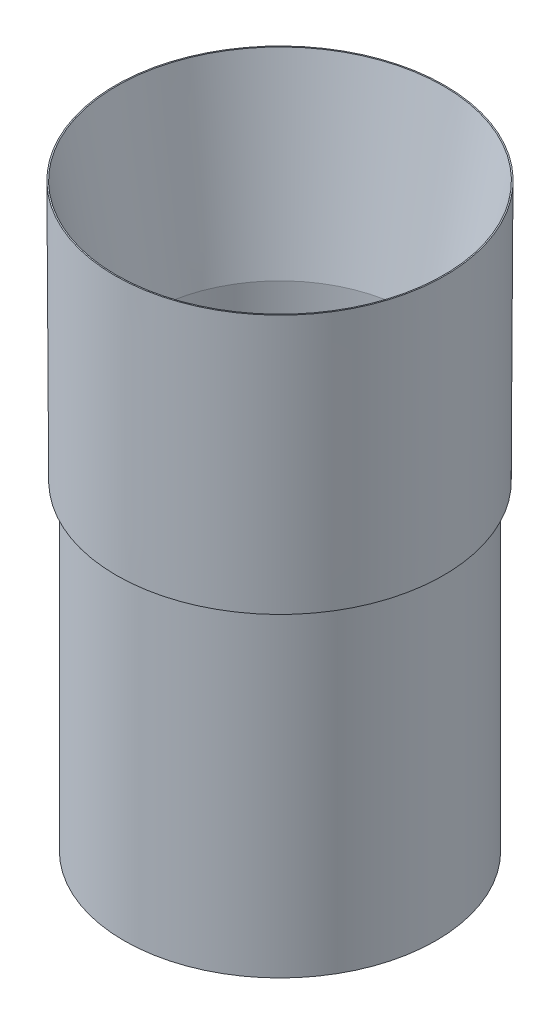
ISO-10303-21;
HEADER;
FILE_DESCRIPTION(('STEP AP214'),'2;1');
FILE_NAME('part.step','',(''),(''),'','','');
FILE_SCHEMA(('AUTOMOTIVE_DESIGN { 1 0 10303 214 1 1 1 1 }'));
ENDSEC;
DATA;
#1=APPLICATION_CONTEXT('core data for automotive mechanical design processes');
#2=APPLICATION_PROTOCOL_DEFINITION('international standard','automotive_design',2000,#1);
#3=PRODUCT_CONTEXT('',#1,'mechanical');
#4=PRODUCT('Part','Part','',(#3));
#5=PRODUCT_RELATED_PRODUCT_CATEGORY('part','',(#4));
#6=PRODUCT_DEFINITION_FORMATION('','',#4);
#7=PRODUCT_DEFINITION_CONTEXT('part definition',#1,'design');
#8=PRODUCT_DEFINITION('design','',#6,#7);
#9=PRODUCT_DEFINITION_SHAPE('','',#8);
#10=(LENGTH_UNIT() NAMED_UNIT(*) SI_UNIT(.MILLI.,.METRE.));
#11=(NAMED_UNIT(*) PLANE_ANGLE_UNIT() SI_UNIT($,.RADIAN.));
#12=(NAMED_UNIT(*) SI_UNIT($,.STERADIAN.) SOLID_ANGLE_UNIT());
#13=UNCERTAINTY_MEASURE_WITH_UNIT(LENGTH_MEASURE(1.E-05),#10,'distance_accuracy_value','');
#14=(GEOMETRIC_REPRESENTATION_CONTEXT(3) GLOBAL_UNCERTAINTY_ASSIGNED_CONTEXT((#13)) GLOBAL_UNIT_ASSIGNED_CONTEXT((#10,
#11,#12)) REPRESENTATION_CONTEXT('',''));
#15=CARTESIAN_POINT('',(0.,0.,0.));
#16=DIRECTION('',(0.,0.,1.));
#17=DIRECTION('',(1.,0.,0.));
#18=AXIS2_PLACEMENT_3D('',#15,#16,#17);
#19=CARTESIAN_POINT('',(0.,0.,0.));
#20=DIRECTION('',(0.,-1.,0.));
#21=DIRECTION('',(0.,0.,-1.));
#22=AXIS2_PLACEMENT_3D('',#19,#20,#21);
#23=CYLINDRICAL_SURFACE('',#22,49.53);
#24=CARTESIAN_POINT('',(0.,-101.6,0.));
#25=DIRECTION('',(0.,-1.,0.));
#26=DIRECTION('',(0.,0.,-1.));
#27=AXIS2_PLACEMENT_3D('',#24,#25,#26);
#28=CIRCLE('',#27,49.53);
#29=CARTESIAN_POINT('',(0.,-101.6,-49.53));
#30=VERTEX_POINT('',#29);
#31=EDGE_CURVE('E10',#30,#30,#28,.T.);
#32=ORIENTED_EDGE('',*,*,#31,.F.);
#33=EDGE_LOOP('',(#32));
#34=FACE_BOUND('',#33,.T.);
#35=CARTESIAN_POINT('',(0.,0.,0.));
#36=DIRECTION('',(0.,-1.,0.));
#37=DIRECTION('',(0.,0.,-1.));
#38=AXIS2_PLACEMENT_3D('',#35,#36,#37);
#39=CIRCLE('',#38,49.53);
#40=CARTESIAN_POINT('',(0.,0.,-49.53));
#41=VERTEX_POINT('',#40);
#42=EDGE_CURVE('E72',#41,#41,#39,.T.);
#43=ORIENTED_EDGE('',*,*,#42,.T.);
#44=EDGE_LOOP('',(#43));
#45=FACE_BOUND('',#44,.T.);
#46=ADVANCED_FACE('F41',(#34,#45),#23,.T.);
#47=CARTESIAN_POINT('',(-47.244,-101.6,0.));
#48=DIRECTION('',(0.,1.,0.));
#49=DIRECTION('',(0.,0.,1.));
#50=AXIS2_PLACEMENT_3D('',#47,#48,#49);
#51=PLANE('',#50);
#52=CARTESIAN_POINT('',(0.,-101.6,0.));
#53=DIRECTION('',(0.,-1.,0.));
#54=DIRECTION('',(0.,0.,-1.));
#55=AXIS2_PLACEMENT_3D('',#52,#53,#54);
#56=CIRCLE('',#55,47.244);
#57=CARTESIAN_POINT('',(0.,-101.6,-47.244));
#58=VERTEX_POINT('',#57);
#59=EDGE_CURVE('E47',#58,#58,#56,.T.);
#60=ORIENTED_EDGE('',*,*,#59,.F.);
#61=EDGE_LOOP('',(#60));
#62=FACE_BOUND('',#61,.T.);
#63=ORIENTED_EDGE('',*,*,#31,.T.);
#64=EDGE_LOOP('',(#63));
#65=FACE_BOUND('',#64,.T.);
#66=ADVANCED_FACE('F115',(#62,#65),#51,.F.);
#67=CARTESIAN_POINT('',(0.,0.,0.));
#68=DIRECTION('',(0.,-1.,0.));
#69=DIRECTION('',(0.,0.,-1.));
#70=AXIS2_PLACEMENT_3D('',#67,#68,#69);
#71=CYLINDRICAL_SURFACE('',#70,47.244);
#72=CARTESIAN_POINT('',(0.,0.,0.));
#73=DIRECTION('',(0.,-1.,0.));
#74=DIRECTION('',(0.,0.,-1.));
#75=AXIS2_PLACEMENT_3D('',#72,#73,#74);
#76=CIRCLE('',#75,47.244);
#77=CARTESIAN_POINT('',(0.,0.,-47.244));
#78=VERTEX_POINT('',#77);
#79=EDGE_CURVE('E51',#78,#78,#76,.T.);
#80=ORIENTED_EDGE('',*,*,#79,.F.);
#81=EDGE_LOOP('',(#80));
#82=FACE_BOUND('',#81,.T.);
#83=ORIENTED_EDGE('',*,*,#59,.T.);
#84=EDGE_LOOP('',(#83));
#85=FACE_BOUND('',#84,.T.);
#86=ADVANCED_FACE('F110',(#82,#85),#71,.F.);
#87=CARTESIAN_POINT('',(-41.866089445666,0.,0.));
#88=DIRECTION('',(0.,1.,0.));
#89=DIRECTION('',(0.,0.,1.));
#90=AXIS2_PLACEMENT_3D('',#87,#88,#89);
#91=PLANE('',#90);
#92=CARTESIAN_POINT('',(0.,0.,0.));
#93=DIRECTION('',(0.,-1.,0.));
#94=DIRECTION('',(0.,0.,-1.));
#95=AXIS2_PLACEMENT_3D('',#92,#93,#94);
#96=CIRCLE('',#95,41.866089445666);
#97=CARTESIAN_POINT('',(0.,0.,-41.866089445666));
#98=VERTEX_POINT('',#97);
#99=EDGE_CURVE('E55',#98,#98,#96,.T.);
#100=ORIENTED_EDGE('',*,*,#99,.F.);
#101=EDGE_LOOP('',(#100));
#102=FACE_BOUND('',#101,.T.);
#103=ORIENTED_EDGE('',*,*,#79,.T.);
#104=EDGE_LOOP('',(#103));
#105=FACE_BOUND('',#104,.T.);
#106=ADVANCED_FACE('F104',(#102,#105),#91,.F.);
#107=CARTESIAN_POINT('',(0.,0.,0.));
#108=DIRECTION('',(0.,-1.,0.));
#109=DIRECTION('',(0.,0.,-1.));
#110=AXIS2_PLACEMENT_3D('',#107,#108,#109);
#111=CYLINDRICAL_SURFACE('',#110,41.866089445666);
#112=CARTESIAN_POINT('',(0.,25.4,0.));
#113=DIRECTION('',(0.,-1.,0.));
#114=DIRECTION('',(0.,0.,-1.));
#115=AXIS2_PLACEMENT_3D('',#112,#113,#114);
#116=CIRCLE('',#115,41.866089445666);
#117=CARTESIAN_POINT('',(0.,25.4,-41.866089445666));
#118=VERTEX_POINT('',#117);
#119=EDGE_CURVE('E60',#118,#118,#116,.T.);
#120=ORIENTED_EDGE('',*,*,#119,.F.);
#121=EDGE_LOOP('',(#120));
#122=FACE_BOUND('',#121,.T.);
#123=ORIENTED_EDGE('',*,*,#99,.T.);
#124=EDGE_LOOP('',(#123));
#125=FACE_BOUND('',#124,.T.);
#126=ADVANCED_FACE('F98',(#122,#125),#111,.F.);
#127=CARTESIAN_POINT('',(0.,25.4,0.));
#128=DIRECTION('',(0.,1.,0.));
#129=DIRECTION('',(0.,0.,1.));
#130=AXIS2_PLACEMENT_3D('',#127,#128,#129);
#131=CONICAL_SURFACE('',#130,41.866089445666,0.174532925199434);
#132=CARTESIAN_POINT('',(0.,82.5489996247077,0.));
#133=DIRECTION('',(0.,-1.,0.));
#134=DIRECTION('',(0.,0.,-1.));
#135=AXIS2_PLACEMENT_3D('',#132,#133,#134);
#136=CIRCLE('',#135,51.943);
#137=CARTESIAN_POINT('',(0.,82.5489996247077,-51.943));
#138=VERTEX_POINT('',#137);
#139=EDGE_CURVE('E63',#138,#138,#136,.T.);
#140=ORIENTED_EDGE('',*,*,#139,.F.);
#141=EDGE_LOOP('',(#140));
#142=FACE_BOUND('',#141,.T.);
#143=ORIENTED_EDGE('',*,*,#119,.T.);
#144=EDGE_LOOP('',(#143));
#145=FACE_BOUND('',#144,.T.);
#146=ADVANCED_FACE('F92',(#142,#145),#131,.F.);
#147=CARTESIAN_POINT('',(-52.324,82.5489996247077,0.));
#148=DIRECTION('',(0.,-1.,0.));
#149=DIRECTION('',(0.,0.,-1.));
#150=AXIS2_PLACEMENT_3D('',#147,#148,#149);
#151=PLANE('',#150);
#152=CARTESIAN_POINT('',(0.,82.5489996247077,0.));
#153=DIRECTION('',(0.,-1.,0.));
#154=DIRECTION('',(0.,0.,-1.));
#155=AXIS2_PLACEMENT_3D('',#152,#153,#154);
#156=CIRCLE('',#155,52.324);
#157=CARTESIAN_POINT('',(0.,82.5489996247077,-52.324));
#158=VERTEX_POINT('',#157);
#159=EDGE_CURVE('E66',#158,#158,#156,.T.);
#160=ORIENTED_EDGE('',*,*,#159,.F.);
#161=EDGE_LOOP('',(#160));
#162=FACE_BOUND('',#161,.T.);
#163=ORIENTED_EDGE('',*,*,#139,.T.);
#164=EDGE_LOOP('',(#163));
#165=FACE_BOUND('',#164,.T.);
#166=ADVANCED_FACE('F86',(#162,#165),#151,.F.);
#167=CARTESIAN_POINT('',(0.,82.5489996247077,0.));
#168=DIRECTION('',(0.,1.,0.));
#169=DIRECTION('',(0.,0.,1.));
#170=AXIS2_PLACEMENT_3D('',#167,#168,#169);
#171=CONICAL_SURFACE('',#170,52.324,0.00492309680980575);
#172=CARTESIAN_POINT('',(0.,0.,0.));
#173=DIRECTION('',(0.,-1.,0.));
#174=DIRECTION('',(0.,0.,-1.));
#175=AXIS2_PLACEMENT_3D('',#172,#173,#174);
#176=CIRCLE('',#175,51.9176);
#177=CARTESIAN_POINT('',(0.,0.,-51.9176));
#178=VERTEX_POINT('',#177);
#179=EDGE_CURVE('E69',#178,#178,#176,.T.);
#180=ORIENTED_EDGE('',*,*,#179,.F.);
#181=EDGE_LOOP('',(#180));
#182=FACE_BOUND('',#181,.T.);
#183=ORIENTED_EDGE('',*,*,#159,.T.);
#184=EDGE_LOOP('',(#183));
#185=FACE_BOUND('',#184,.T.);
#186=ADVANCED_FACE('F80',(#182,#185),#171,.T.);
#187=CARTESIAN_POINT('',(-49.53,0.,0.));
#188=DIRECTION('',(0.,1.,0.));
#189=DIRECTION('',(0.,0.,1.));
#190=AXIS2_PLACEMENT_3D('',#187,#188,#189);
#191=PLANE('',#190);
#192=ORIENTED_EDGE('',*,*,#42,.F.);
#193=EDGE_LOOP('',(#192));
#194=FACE_BOUND('',#193,.T.);
#195=ORIENTED_EDGE('',*,*,#179,.T.);
#196=EDGE_LOOP('',(#195));
#197=FACE_BOUND('',#196,.T.);
#198=ADVANCED_FACE('F77',(#194,#197),#191,.F.);
#199=CLOSED_SHELL('',(#46,#66,#86,#106,#126,#146,#166,#186,#198));
#200=MANIFOLD_SOLID_BREP('B2',#199);
#201=ADVANCED_BREP_SHAPE_REPRESENTATION('',(#18,#200),#14);
#202=SHAPE_DEFINITION_REPRESENTATION(#9,#201);
ENDSEC;
END-ISO-10303-21;
